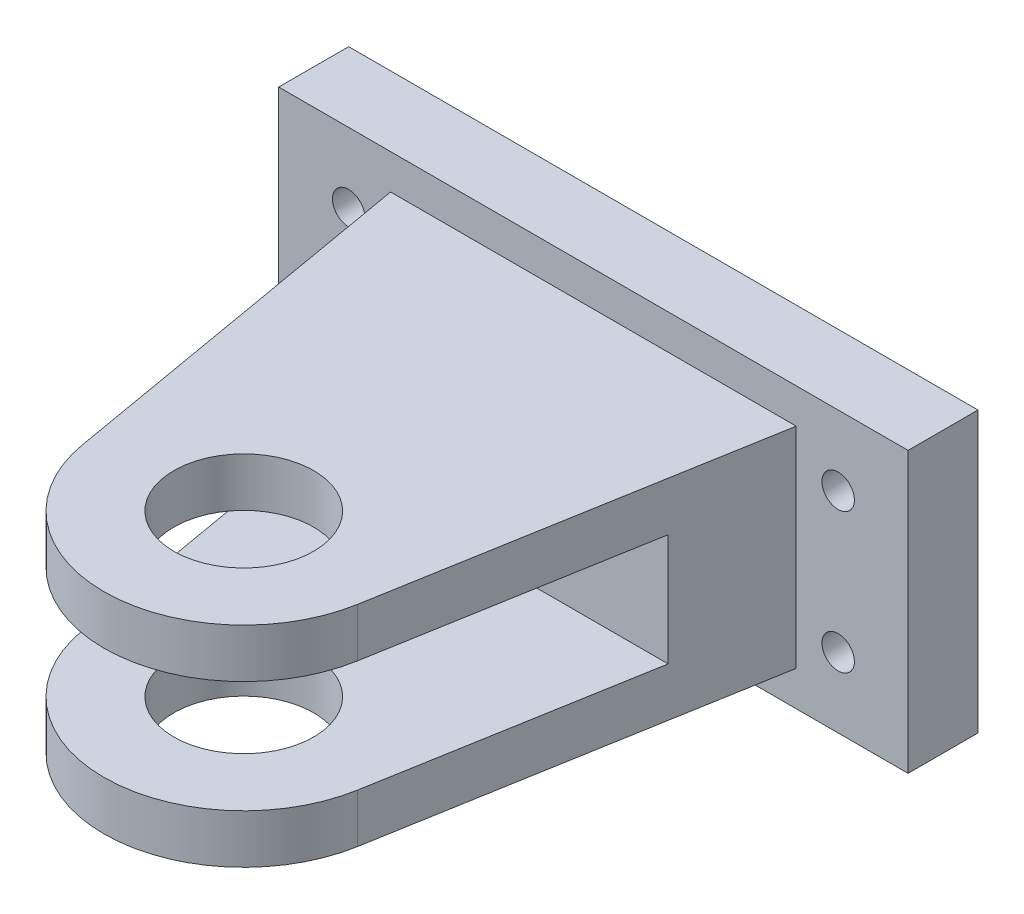
ISO-10303-21;
HEADER;
FILE_DESCRIPTION(('STEP AP214'),'2;1');
FILE_NAME('part.step','',(''),(''),'','','');
FILE_SCHEMA(('AUTOMOTIVE_DESIGN { 1 0 10303 214 1 1 1 1 }'));
ENDSEC;
DATA;
#1=APPLICATION_CONTEXT('core data for automotive mechanical design processes');
#2=APPLICATION_PROTOCOL_DEFINITION('international standard','automotive_design',2000,#1);
#3=PRODUCT_CONTEXT('',#1,'mechanical');
#4=PRODUCT('Part','Part','',(#3));
#5=PRODUCT_RELATED_PRODUCT_CATEGORY('part','',(#4));
#6=PRODUCT_DEFINITION_FORMATION('','',#4);
#7=PRODUCT_DEFINITION_CONTEXT('part definition',#1,'design');
#8=PRODUCT_DEFINITION('design','',#6,#7);
#9=PRODUCT_DEFINITION_SHAPE('','',#8);
#10=(LENGTH_UNIT() NAMED_UNIT(*) SI_UNIT(.MILLI.,.METRE.));
#11=(NAMED_UNIT(*) PLANE_ANGLE_UNIT() SI_UNIT($,.RADIAN.));
#12=(NAMED_UNIT(*) SI_UNIT($,.STERADIAN.) SOLID_ANGLE_UNIT());
#13=UNCERTAINTY_MEASURE_WITH_UNIT(LENGTH_MEASURE(1.E-05),#10,'distance_accuracy_value','');
#14=(GEOMETRIC_REPRESENTATION_CONTEXT(3) GLOBAL_UNCERTAINTY_ASSIGNED_CONTEXT((#13)) GLOBAL_UNIT_ASSIGNED_CONTEXT((#10,
#11,#12)) REPRESENTATION_CONTEXT('',''));
#15=CARTESIAN_POINT('',(0.,0.,0.));
#16=DIRECTION('',(0.,0.,1.));
#17=DIRECTION('',(1.,0.,0.));
#18=AXIS2_PLACEMENT_3D('',#15,#16,#17);
#19=CARTESIAN_POINT('',(0.,9.525,38.1));
#20=DIRECTION('',(0.,-1.,0.));
#21=DIRECTION('',(0.,0.,-1.));
#22=AXIS2_PLACEMENT_3D('',#19,#20,#21);
#23=CYLINDRICAL_SURFACE('',#22,12.7);
#24=CARTESIAN_POINT('',(0.,-5.08,38.1));
#25=DIRECTION('',(0.,1.,0.));
#26=DIRECTION('',(0.,0.,1.));
#27=AXIS2_PLACEMENT_3D('',#24,#25,#26);
#28=CIRCLE('',#27,12.7);
#29=CARTESIAN_POINT('',(-12.5120254510353,-5.08,40.2769747616005));
#30=VERTEX_POINT('',#29);
#31=CARTESIAN_POINT('',(12.5120254510353,-5.08,40.2769747616005));
#32=VERTEX_POINT('',#31);
#33=EDGE_CURVE('E132',#30,#32,#28,.T.);
#34=ORIENTED_EDGE('',*,*,#33,.F.);
#35=DIRECTION('',(0.,-1.,0.));
#36=VECTOR('',#35,1.);
#37=CARTESIAN_POINT('',(-12.5120254510353,9.525,40.2769747616005));
#38=LINE('',#37,#36);
#39=CARTESIAN_POINT('',(-12.5120254510353,-9.525,40.2769747616005));
#40=VERTEX_POINT('',#39);
#41=EDGE_CURVE('E144',#30,#40,#38,.T.);
#42=ORIENTED_EDGE('',*,*,#41,.T.);
#43=CARTESIAN_POINT('',(0.,-9.525,38.1));
#44=DIRECTION('',(0.,1.,0.));
#45=DIRECTION('',(0.,0.,1.));
#46=AXIS2_PLACEMENT_3D('',#43,#44,#45);
#47=CIRCLE('',#46,12.7);
#48=CARTESIAN_POINT('',(12.5120254510353,-9.525,40.2769747616005));
#49=VERTEX_POINT('',#48);
#50=EDGE_CURVE('E235',#40,#49,#47,.T.);
#51=ORIENTED_EDGE('',*,*,#50,.T.);
#52=DIRECTION('',(0.,-1.,0.));
#53=VECTOR('',#52,1.);
#54=CARTESIAN_POINT('',(12.5120254510353,9.525,40.2769747616005));
#55=LINE('',#54,#53);
#56=EDGE_CURVE('E146',#32,#49,#55,.T.);
#57=ORIENTED_EDGE('',*,*,#56,.F.);
#58=EDGE_LOOP('',(#34,#42,#51,#57));
#59=FACE_BOUND('',#58,.T.);
#60=ADVANCED_FACE('F37',(#59),#23,.T.);
#61=CARTESIAN_POINT('',(12.5120254510353,9.525,40.2769747616005));
#62=DIRECTION('',(-0.985198854412227,0.,-0.171415335559091));
#63=DIRECTION('',(-0.171415335559091,0.,0.985198854412227));
#64=AXIS2_PLACEMENT_3D('',#61,#62,#63);
#65=PLANE('',#64);
#66=DIRECTION('',(0.171415335559091,0.,-0.985198854412227));
#67=VECTOR('',#66,1.);
#68=CARTESIAN_POINT('',(12.5120254510353,-5.08,40.2769747616005));
#69=LINE('',#68,#67);
#70=CARTESIAN_POINT('',(16.6914491590265,-5.08,16.256));
#71=VERTEX_POINT('',#70);
#72=EDGE_CURVE('E147',#32,#71,#69,.T.);
#73=ORIENTED_EDGE('',*,*,#72,.F.);
#74=ORIENTED_EDGE('',*,*,#56,.T.);
#75=DIRECTION('',(0.171415335559091,0.,-0.985198854412227));
#76=VECTOR('',#75,1.);
#77=CARTESIAN_POINT('',(12.5120254510353,-9.525,40.2769747616005));
#78=LINE('',#77,#76);
#79=CARTESIAN_POINT('',(18.415,-9.525,6.35));
#80=VERTEX_POINT('',#79);
#81=EDGE_CURVE('E62',#49,#80,#78,.T.);
#82=ORIENTED_EDGE('',*,*,#81,.T.);
#83=DIRECTION('',(0.,-1.,0.));
#84=VECTOR('',#83,1.);
#85=CARTESIAN_POINT('',(18.415,9.525,6.35));
#86=LINE('',#85,#84);
#87=CARTESIAN_POINT('',(18.415,9.525,6.35));
#88=VERTEX_POINT('',#87);
#89=EDGE_CURVE('E164',#88,#80,#86,.T.);
#90=ORIENTED_EDGE('',*,*,#89,.F.);
#91=DIRECTION('',(0.171415335559091,0.,-0.985198854412227));
#92=VECTOR('',#91,1.);
#93=CARTESIAN_POINT('',(12.5120254510353,9.525,40.2769747616005));
#94=LINE('',#93,#92);
#95=CARTESIAN_POINT('',(12.5120254510353,9.525,40.2769747616005));
#96=VERTEX_POINT('',#95);
#97=EDGE_CURVE('E241',#96,#88,#94,.T.);
#98=ORIENTED_EDGE('',*,*,#97,.F.);
#99=CARTESIAN_POINT('',(12.5120254510353,5.08,40.2769747616005));
#100=VERTEX_POINT('',#99);
#101=EDGE_CURVE('E167',#96,#100,#55,.T.);
#102=ORIENTED_EDGE('',*,*,#101,.T.);
#103=DIRECTION('',(0.171415335559091,0.,-0.985198854412227));
#104=VECTOR('',#103,1.);
#105=CARTESIAN_POINT('',(12.5120254510353,5.08,40.2769747616005));
#106=LINE('',#105,#104);
#107=CARTESIAN_POINT('',(16.6914491590265,5.08,16.256));
#108=VERTEX_POINT('',#107);
#109=EDGE_CURVE('E301',#100,#108,#106,.T.);
#110=ORIENTED_EDGE('',*,*,#109,.T.);
#111=DIRECTION('',(0.,1.,0.));
#112=VECTOR('',#111,1.);
#113=CARTESIAN_POINT('',(16.6914491590265,-5.08,16.256));
#114=LINE('',#113,#112);
#115=EDGE_CURVE('E226',#71,#108,#114,.T.);
#116=ORIENTED_EDGE('',*,*,#115,.F.);
#117=EDGE_LOOP('',(#73,#74,#82,#90,#98,#102,#110,#116));
#118=FACE_BOUND('',#117,.T.);
#119=ADVANCED_FACE('F280',(#118),#65,.F.);
#120=CARTESIAN_POINT('',(-12.5120254510353,9.525,40.2769747616005));
#121=DIRECTION('',(0.985198854412227,0.,-0.171415335559091));
#122=DIRECTION('',(-0.171415335559091,0.,-0.985198854412227));
#123=AXIS2_PLACEMENT_3D('',#120,#121,#122);
#124=PLANE('',#123);
#125=DIRECTION('',(0.171415335559092,0.,0.985198854412227));
#126=VECTOR('',#125,1.);
#127=CARTESIAN_POINT('',(-16.6914491590265,-5.08,16.256));
#128=LINE('',#127,#126);
#129=CARTESIAN_POINT('',(-16.6914491590265,-5.08,16.256));
#130=VERTEX_POINT('',#129);
#131=EDGE_CURVE('E129',#130,#30,#128,.T.);
#132=ORIENTED_EDGE('',*,*,#131,.F.);
#133=DIRECTION('',(0.,1.,0.));
#134=VECTOR('',#133,1.);
#135=CARTESIAN_POINT('',(-16.6914491590265,-5.08,16.256));
#136=LINE('',#135,#134);
#137=CARTESIAN_POINT('',(-16.6914491590265,5.08,16.256));
#138=VERTEX_POINT('',#137);
#139=EDGE_CURVE('E221',#130,#138,#136,.T.);
#140=ORIENTED_EDGE('',*,*,#139,.T.);
#141=DIRECTION('',(0.171415335559092,0.,0.985198854412227));
#142=VECTOR('',#141,1.);
#143=CARTESIAN_POINT('',(-16.6914491590265,5.08,16.256));
#144=LINE('',#143,#142);
#145=CARTESIAN_POINT('',(-12.5120254510353,5.08,40.2769747616005));
#146=VERTEX_POINT('',#145);
#147=EDGE_CURVE('E297',#138,#146,#144,.T.);
#148=ORIENTED_EDGE('',*,*,#147,.T.);
#149=CARTESIAN_POINT('',(-12.5120254510353,9.525,40.2769747616005));
#150=VERTEX_POINT('',#149);
#151=EDGE_CURVE('E153',#150,#146,#38,.T.);
#152=ORIENTED_EDGE('',*,*,#151,.F.);
#153=DIRECTION('',(0.171415335559091,0.,0.985198854412227));
#154=VECTOR('',#153,1.);
#155=CARTESIAN_POINT('',(-12.5120254510353,9.525,40.2769747616005));
#156=LINE('',#155,#154);
#157=CARTESIAN_POINT('',(-18.415,9.525,6.35));
#158=VERTEX_POINT('',#157);
#159=EDGE_CURVE('E154',#158,#150,#156,.T.);
#160=ORIENTED_EDGE('',*,*,#159,.F.);
#161=DIRECTION('',(0.,-1.,0.));
#162=VECTOR('',#161,1.);
#163=CARTESIAN_POINT('',(-18.415,9.525,6.35));
#164=LINE('',#163,#162);
#165=CARTESIAN_POINT('',(-18.415,-9.525,6.35));
#166=VERTEX_POINT('',#165);
#167=EDGE_CURVE('E157',#158,#166,#164,.T.);
#168=ORIENTED_EDGE('',*,*,#167,.T.);
#169=DIRECTION('',(0.171415335559091,0.,0.985198854412227));
#170=VECTOR('',#169,1.);
#171=CARTESIAN_POINT('',(-12.5120254510353,-9.525,40.2769747616005));
#172=LINE('',#171,#170);
#173=EDGE_CURVE('E151',#166,#40,#172,.T.);
#174=ORIENTED_EDGE('',*,*,#173,.T.);
#175=ORIENTED_EDGE('',*,*,#41,.F.);
#176=EDGE_LOOP('',(#132,#140,#148,#152,#160,#168,#174,#175));
#177=FACE_BOUND('',#176,.T.);
#178=ADVANCED_FACE('F149',(#177),#124,.F.);
#179=CARTESIAN_POINT('',(0.,9.525,38.1));
#180=DIRECTION('',(0.,-1.,0.));
#181=DIRECTION('',(0.,0.,-1.));
#182=AXIS2_PLACEMENT_3D('',#179,#180,#181);
#183=CYLINDRICAL_SURFACE('',#182,6.35);
#184=CARTESIAN_POINT('',(0.,-9.525,38.1));
#185=DIRECTION('',(0.,1.,0.));
#186=DIRECTION('',(0.,0.,1.));
#187=AXIS2_PLACEMENT_3D('',#184,#185,#186);
#188=CIRCLE('',#187,6.35);
#189=CARTESIAN_POINT('',(0.,-9.525,44.45));
#190=VERTEX_POINT('',#189);
#191=EDGE_CURVE('E225',#190,#190,#188,.T.);
#192=ORIENTED_EDGE('',*,*,#191,.F.);
#193=EDGE_LOOP('',(#192));
#194=FACE_BOUND('',#193,.T.);
#195=CARTESIAN_POINT('',(0.,-5.08,38.1));
#196=DIRECTION('',(0.,1.,0.));
#197=DIRECTION('',(0.,0.,1.));
#198=AXIS2_PLACEMENT_3D('',#195,#196,#197);
#199=CIRCLE('',#198,6.35);
#200=CARTESIAN_POINT('',(0.,-5.08,44.45));
#201=VERTEX_POINT('',#200);
#202=EDGE_CURVE('E41',#201,#201,#199,.T.);
#203=ORIENTED_EDGE('',*,*,#202,.T.);
#204=EDGE_LOOP('',(#203));
#205=FACE_BOUND('',#204,.T.);
#206=ADVANCED_FACE('F261',(#194,#205),#183,.F.);
#207=CARTESIAN_POINT('',(0.,0.,6.35));
#208=DIRECTION('',(0.,0.,-1.));
#209=DIRECTION('',(-1.,0.,0.));
#210=AXIS2_PLACEMENT_3D('',#207,#208,#209);
#211=PLANE('',#210);
#212=ORIENTED_EDGE('',*,*,#89,.T.);
#213=DIRECTION('',(-1.,0.,0.));
#214=VECTOR('',#213,1.);
#215=CARTESIAN_POINT('',(-18.415,-9.525,6.35));
#216=LINE('',#215,#214);
#217=EDGE_CURVE('E245',#80,#166,#216,.T.);
#218=ORIENTED_EDGE('',*,*,#217,.T.);
#219=ORIENTED_EDGE('',*,*,#167,.F.);
#220=DIRECTION('',(-1.,0.,0.));
#221=VECTOR('',#220,1.);
#222=CARTESIAN_POINT('',(-18.415,9.525,6.35));
#223=LINE('',#222,#221);
#224=EDGE_CURVE('E158',#88,#158,#223,.T.);
#225=ORIENTED_EDGE('',*,*,#224,.F.);
#226=EDGE_LOOP('',(#212,#218,#219,#225));
#227=FACE_BOUND('',#226,.T.);
#228=DIRECTION('',(0.,1.,0.));
#229=VECTOR('',#228,1.);
#230=CARTESIAN_POINT('',(28.575,-12.7,6.35));
#231=LINE('',#230,#229);
#232=CARTESIAN_POINT('',(28.575,-12.7,6.35));
#233=VERTEX_POINT('',#232);
#234=CARTESIAN_POINT('',(28.575,12.7,6.35));
#235=VERTEX_POINT('',#234);
#236=EDGE_CURVE('E195',#233,#235,#231,.T.);
#237=ORIENTED_EDGE('',*,*,#236,.T.);
#238=DIRECTION('',(-1.,0.,0.));
#239=VECTOR('',#238,1.);
#240=CARTESIAN_POINT('',(-28.575,12.7,6.35));
#241=LINE('',#240,#239);
#242=CARTESIAN_POINT('',(-28.575,12.7,6.35));
#243=VERTEX_POINT('',#242);
#244=EDGE_CURVE('E198',#235,#243,#241,.T.);
#245=ORIENTED_EDGE('',*,*,#244,.T.);
#246=DIRECTION('',(0.,-1.,0.));
#247=VECTOR('',#246,1.);
#248=CARTESIAN_POINT('',(-28.575,-12.7,6.35));
#249=LINE('',#248,#247);
#250=CARTESIAN_POINT('',(-28.575,-12.7,6.35));
#251=VERTEX_POINT('',#250);
#252=EDGE_CURVE('E201',#243,#251,#249,.T.);
#253=ORIENTED_EDGE('',*,*,#252,.T.);
#254=DIRECTION('',(1.,0.,0.));
#255=VECTOR('',#254,1.);
#256=CARTESIAN_POINT('',(-28.575,-12.7,6.35));
#257=LINE('',#256,#255);
#258=EDGE_CURVE('E203',#251,#233,#257,.T.);
#259=ORIENTED_EDGE('',*,*,#258,.T.);
#260=EDGE_LOOP('',(#237,#245,#253,#259));
#261=FACE_BOUND('',#260,.T.);
#262=CARTESIAN_POINT('',(22.225,6.35,6.35));
#263=DIRECTION('',(0.,0.,1.));
#264=DIRECTION('',(1.,0.,0.));
#265=AXIS2_PLACEMENT_3D('',#262,#263,#264);
#266=CIRCLE('',#265,1.4732);
#267=CARTESIAN_POINT('',(23.6982,6.35,6.35));
#268=VERTEX_POINT('',#267);
#269=EDGE_CURVE('E188',#268,#268,#266,.T.);
#270=ORIENTED_EDGE('',*,*,#269,.F.);
#271=EDGE_LOOP('',(#270));
#272=FACE_BOUND('',#271,.T.);
#273=CARTESIAN_POINT('',(-22.225,-6.35,6.35));
#274=DIRECTION('',(0.,0.,1.));
#275=DIRECTION('',(1.,0.,0.));
#276=AXIS2_PLACEMENT_3D('',#273,#274,#275);
#277=CIRCLE('',#276,1.4732);
#278=CARTESIAN_POINT('',(-20.7518,-6.35,6.35));
#279=VERTEX_POINT('',#278);
#280=EDGE_CURVE('E182',#279,#279,#277,.T.);
#281=ORIENTED_EDGE('',*,*,#280,.F.);
#282=EDGE_LOOP('',(#281));
#283=FACE_BOUND('',#282,.T.);
#284=CARTESIAN_POINT('',(22.225,-6.35,6.35));
#285=DIRECTION('',(0.,0.,1.));
#286=DIRECTION('',(1.,0.,0.));
#287=AXIS2_PLACEMENT_3D('',#284,#285,#286);
#288=CIRCLE('',#287,1.4732);
#289=CARTESIAN_POINT('',(23.6982,-6.35,6.35));
#290=VERTEX_POINT('',#289);
#291=EDGE_CURVE('E176',#290,#290,#288,.T.);
#292=ORIENTED_EDGE('',*,*,#291,.F.);
#293=EDGE_LOOP('',(#292));
#294=FACE_BOUND('',#293,.T.);
#295=CARTESIAN_POINT('',(-22.225,6.35,6.35));
#296=DIRECTION('',(0.,0.,1.));
#297=DIRECTION('',(1.,0.,0.));
#298=AXIS2_PLACEMENT_3D('',#295,#296,#297);
#299=CIRCLE('',#298,1.4732);
#300=CARTESIAN_POINT('',(-20.7518,6.35,6.35));
#301=VERTEX_POINT('',#300);
#302=EDGE_CURVE('E170',#301,#301,#299,.T.);
#303=ORIENTED_EDGE('',*,*,#302,.F.);
#304=EDGE_LOOP('',(#303));
#305=FACE_BOUND('',#304,.T.);
#306=ADVANCED_FACE('F249',(#227,#261,#272,#283,#294,#305),#211,.F.);
#307=CARTESIAN_POINT('',(28.575,-12.7,6.35));
#308=DIRECTION('',(-1.,0.,0.));
#309=DIRECTION('',(0.,0.,1.));
#310=AXIS2_PLACEMENT_3D('',#307,#308,#309);
#311=PLANE('',#310);
#312=DIRECTION('',(0.,1.,0.));
#313=VECTOR('',#312,1.);
#314=CARTESIAN_POINT('',(28.575,-12.7,0.));
#315=LINE('',#314,#313);
#316=CARTESIAN_POINT('',(28.575,-12.7,0.));
#317=VERTEX_POINT('',#316);
#318=CARTESIAN_POINT('',(28.575,12.7,0.));
#319=VERTEX_POINT('',#318);
#320=EDGE_CURVE('E194',#317,#319,#315,.T.);
#321=ORIENTED_EDGE('',*,*,#320,.T.);
#322=DIRECTION('',(0.,0.,-1.));
#323=VECTOR('',#322,1.);
#324=CARTESIAN_POINT('',(28.575,12.7,6.35));
#325=LINE('',#324,#323);
#326=EDGE_CURVE('E11',#235,#319,#325,.T.);
#327=ORIENTED_EDGE('',*,*,#326,.F.);
#328=ORIENTED_EDGE('',*,*,#236,.F.);
#329=DIRECTION('',(0.,0.,-1.));
#330=VECTOR('',#329,1.);
#331=CARTESIAN_POINT('',(28.575,-12.7,6.35));
#332=LINE('',#331,#330);
#333=EDGE_CURVE('E205',#233,#317,#332,.T.);
#334=ORIENTED_EDGE('',*,*,#333,.T.);
#335=EDGE_LOOP('',(#321,#327,#328,#334));
#336=FACE_BOUND('',#335,.T.);
#337=ADVANCED_FACE('F39',(#336),#311,.F.);
#338=CARTESIAN_POINT('',(-28.575,12.7,6.35));
#339=DIRECTION('',(0.,-1.,0.));
#340=DIRECTION('',(0.,0.,-1.));
#341=AXIS2_PLACEMENT_3D('',#338,#339,#340);
#342=PLANE('',#341);
#343=DIRECTION('',(-1.,0.,0.));
#344=VECTOR('',#343,1.);
#345=CARTESIAN_POINT('',(-28.575,12.7,0.));
#346=LINE('',#345,#344);
#347=CARTESIAN_POINT('',(-28.575,12.7,0.));
#348=VERTEX_POINT('',#347);
#349=EDGE_CURVE('E208',#319,#348,#346,.T.);
#350=ORIENTED_EDGE('',*,*,#349,.T.);
#351=DIRECTION('',(0.,0.,-1.));
#352=VECTOR('',#351,1.);
#353=CARTESIAN_POINT('',(-28.575,12.7,6.35));
#354=LINE('',#353,#352);
#355=EDGE_CURVE('E46',#243,#348,#354,.T.);
#356=ORIENTED_EDGE('',*,*,#355,.F.);
#357=ORIENTED_EDGE('',*,*,#244,.F.);
#358=ORIENTED_EDGE('',*,*,#326,.T.);
#359=EDGE_LOOP('',(#350,#356,#357,#358));
#360=FACE_BOUND('',#359,.T.);
#361=ADVANCED_FACE('F342',(#360),#342,.F.);
#362=CARTESIAN_POINT('',(-28.575,-12.7,6.35));
#363=DIRECTION('',(1.,0.,0.));
#364=DIRECTION('',(0.,0.,-1.));
#365=AXIS2_PLACEMENT_3D('',#362,#363,#364);
#366=PLANE('',#365);
#367=DIRECTION('',(0.,-1.,0.));
#368=VECTOR('',#367,1.);
#369=CARTESIAN_POINT('',(-28.575,-12.7,0.));
#370=LINE('',#369,#368);
#371=CARTESIAN_POINT('',(-28.575,-12.7,0.));
#372=VERTEX_POINT('',#371);
#373=EDGE_CURVE('E210',#348,#372,#370,.T.);
#374=ORIENTED_EDGE('',*,*,#373,.T.);
#375=DIRECTION('',(0.,0.,-1.));
#376=VECTOR('',#375,1.);
#377=CARTESIAN_POINT('',(-28.575,-12.7,6.35));
#378=LINE('',#377,#376);
#379=EDGE_CURVE('E215',#251,#372,#378,.T.);
#380=ORIENTED_EDGE('',*,*,#379,.F.);
#381=ORIENTED_EDGE('',*,*,#252,.F.);
#382=ORIENTED_EDGE('',*,*,#355,.T.);
#383=EDGE_LOOP('',(#374,#380,#381,#382));
#384=FACE_BOUND('',#383,.T.);
#385=ADVANCED_FACE('F349',(#384),#366,.F.);
#386=CARTESIAN_POINT('',(-28.575,-12.7,6.35));
#387=DIRECTION('',(0.,1.,0.));
#388=DIRECTION('',(0.,0.,1.));
#389=AXIS2_PLACEMENT_3D('',#386,#387,#388);
#390=PLANE('',#389);
#391=DIRECTION('',(1.,0.,0.));
#392=VECTOR('',#391,1.);
#393=CARTESIAN_POINT('',(-28.575,-12.7,0.));
#394=LINE('',#393,#392);
#395=EDGE_CURVE('E199',#372,#317,#394,.T.);
#396=ORIENTED_EDGE('',*,*,#395,.T.);
#397=ORIENTED_EDGE('',*,*,#333,.F.);
#398=ORIENTED_EDGE('',*,*,#258,.F.);
#399=ORIENTED_EDGE('',*,*,#379,.T.);
#400=EDGE_LOOP('',(#396,#397,#398,#399));
#401=FACE_BOUND('',#400,.T.);
#402=ADVANCED_FACE('F356',(#401),#390,.F.);
#403=CARTESIAN_POINT('',(0.,0.,0.));
#404=DIRECTION('',(0.,0.,-1.));
#405=DIRECTION('',(-1.,0.,0.));
#406=AXIS2_PLACEMENT_3D('',#403,#404,#405);
#407=PLANE('',#406);
#408=CARTESIAN_POINT('',(-22.225,6.35,0.));
#409=DIRECTION('',(0.,0.,-1.));
#410=DIRECTION('',(-1.,0.,0.));
#411=AXIS2_PLACEMENT_3D('',#408,#409,#410);
#412=CIRCLE('',#411,1.4732);
#413=CARTESIAN_POINT('',(-23.6982,6.35,0.));
#414=VERTEX_POINT('',#413);
#415=EDGE_CURVE('E173',#414,#414,#412,.T.);
#416=ORIENTED_EDGE('',*,*,#415,.F.);
#417=EDGE_LOOP('',(#416));
#418=FACE_BOUND('',#417,.T.);
#419=CARTESIAN_POINT('',(22.225,-6.35,0.));
#420=DIRECTION('',(0.,0.,-1.));
#421=DIRECTION('',(-1.,0.,0.));
#422=AXIS2_PLACEMENT_3D('',#419,#420,#421);
#423=CIRCLE('',#422,1.4732);
#424=CARTESIAN_POINT('',(20.7518,-6.35,0.));
#425=VERTEX_POINT('',#424);
#426=EDGE_CURVE('E179',#425,#425,#423,.T.);
#427=ORIENTED_EDGE('',*,*,#426,.F.);
#428=EDGE_LOOP('',(#427));
#429=FACE_BOUND('',#428,.T.);
#430=CARTESIAN_POINT('',(-22.225,-6.35,0.));
#431=DIRECTION('',(0.,0.,-1.));
#432=DIRECTION('',(-1.,0.,0.));
#433=AXIS2_PLACEMENT_3D('',#430,#431,#432);
#434=CIRCLE('',#433,1.4732);
#435=CARTESIAN_POINT('',(-23.6982,-6.35,0.));
#436=VERTEX_POINT('',#435);
#437=EDGE_CURVE('E185',#436,#436,#434,.T.);
#438=ORIENTED_EDGE('',*,*,#437,.F.);
#439=EDGE_LOOP('',(#438));
#440=FACE_BOUND('',#439,.T.);
#441=CARTESIAN_POINT('',(22.225,6.35,0.));
#442=DIRECTION('',(0.,0.,-1.));
#443=DIRECTION('',(-1.,0.,0.));
#444=AXIS2_PLACEMENT_3D('',#441,#442,#443);
#445=CIRCLE('',#444,1.4732);
#446=CARTESIAN_POINT('',(20.7518,6.35,0.));
#447=VERTEX_POINT('',#446);
#448=EDGE_CURVE('E191',#447,#447,#445,.T.);
#449=ORIENTED_EDGE('',*,*,#448,.F.);
#450=EDGE_LOOP('',(#449));
#451=FACE_BOUND('',#450,.T.);
#452=ORIENTED_EDGE('',*,*,#320,.F.);
#453=ORIENTED_EDGE('',*,*,#395,.F.);
#454=ORIENTED_EDGE('',*,*,#373,.F.);
#455=ORIENTED_EDGE('',*,*,#349,.F.);
#456=EDGE_LOOP('',(#452,#453,#454,#455));
#457=FACE_BOUND('',#456,.T.);
#458=ADVANCED_FACE('F364',(#418,#429,#440,#451,#457),#407,.T.);
#459=CARTESIAN_POINT('',(22.225,6.35,6.35));
#460=DIRECTION('',(0.,0.,1.));
#461=DIRECTION('',(1.,0.,0.));
#462=AXIS2_PLACEMENT_3D('',#459,#460,#461);
#463=CYLINDRICAL_SURFACE('',#462,1.4732);
#464=ORIENTED_EDGE('',*,*,#269,.T.);
#465=EDGE_LOOP('',(#464));
#466=FACE_BOUND('',#465,.T.);
#467=ORIENTED_EDGE('',*,*,#448,.T.);
#468=EDGE_LOOP('',(#467));
#469=FACE_BOUND('',#468,.T.);
#470=ADVANCED_FACE('F372',(#466,#469),#463,.F.);
#471=CARTESIAN_POINT('',(-22.225,-6.35,6.35));
#472=DIRECTION('',(0.,0.,1.));
#473=DIRECTION('',(1.,0.,0.));
#474=AXIS2_PLACEMENT_3D('',#471,#472,#473);
#475=CYLINDRICAL_SURFACE('',#474,1.4732);
#476=ORIENTED_EDGE('',*,*,#280,.T.);
#477=EDGE_LOOP('',(#476));
#478=FACE_BOUND('',#477,.T.);
#479=ORIENTED_EDGE('',*,*,#437,.T.);
#480=EDGE_LOOP('',(#479));
#481=FACE_BOUND('',#480,.T.);
#482=ADVANCED_FACE('F380',(#478,#481),#475,.F.);
#483=CARTESIAN_POINT('',(22.225,-6.35,6.35));
#484=DIRECTION('',(0.,0.,1.));
#485=DIRECTION('',(1.,0.,0.));
#486=AXIS2_PLACEMENT_3D('',#483,#484,#485);
#487=CYLINDRICAL_SURFACE('',#486,1.4732);
#488=ORIENTED_EDGE('',*,*,#291,.T.);
#489=EDGE_LOOP('',(#488));
#490=FACE_BOUND('',#489,.T.);
#491=ORIENTED_EDGE('',*,*,#426,.T.);
#492=EDGE_LOOP('',(#491));
#493=FACE_BOUND('',#492,.T.);
#494=ADVANCED_FACE('F317',(#490,#493),#487,.F.);
#495=CARTESIAN_POINT('',(-22.225,6.35,6.35));
#496=DIRECTION('',(0.,0.,1.));
#497=DIRECTION('',(1.,0.,0.));
#498=AXIS2_PLACEMENT_3D('',#495,#496,#497);
#499=CYLINDRICAL_SURFACE('',#498,1.4732);
#500=ORIENTED_EDGE('',*,*,#302,.T.);
#501=EDGE_LOOP('',(#500));
#502=FACE_BOUND('',#501,.T.);
#503=ORIENTED_EDGE('',*,*,#415,.T.);
#504=EDGE_LOOP('',(#503));
#505=FACE_BOUND('',#504,.T.);
#506=ADVANCED_FACE('F310',(#502,#505),#499,.F.);
#507=CARTESIAN_POINT('',(0.,9.525,38.1));
#508=DIRECTION('',(0.,1.,0.));
#509=DIRECTION('',(0.,0.,1.));
#510=AXIS2_PLACEMENT_3D('',#507,#508,#509);
#511=PLANE('',#510);
#512=ORIENTED_EDGE('',*,*,#97,.T.);
#513=ORIENTED_EDGE('',*,*,#224,.T.);
#514=ORIENTED_EDGE('',*,*,#159,.T.);
#515=CARTESIAN_POINT('',(0.,9.525,38.1));
#516=DIRECTION('',(0.,1.,0.));
#517=DIRECTION('',(0.,0.,1.));
#518=AXIS2_PLACEMENT_3D('',#515,#516,#517);
#519=CIRCLE('',#518,12.7);
#520=EDGE_CURVE('E238',#150,#96,#519,.T.);
#521=ORIENTED_EDGE('',*,*,#520,.T.);
#522=EDGE_LOOP('',(#512,#513,#514,#521));
#523=FACE_BOUND('',#522,.T.);
#524=CARTESIAN_POINT('',(0.,9.525,38.1));
#525=DIRECTION('',(0.,1.,0.));
#526=DIRECTION('',(0.,0.,1.));
#527=AXIS2_PLACEMENT_3D('',#524,#525,#526);
#528=CIRCLE('',#527,6.35);
#529=CARTESIAN_POINT('',(0.,9.525,44.45));
#530=VERTEX_POINT('',#529);
#531=EDGE_CURVE('E232',#530,#530,#528,.T.);
#532=ORIENTED_EDGE('',*,*,#531,.F.);
#533=EDGE_LOOP('',(#532));
#534=FACE_BOUND('',#533,.T.);
#535=ADVANCED_FACE('F257',(#523,#534),#511,.T.);
#536=CARTESIAN_POINT('',(0.,-9.525,38.1));
#537=DIRECTION('',(0.,1.,0.));
#538=DIRECTION('',(0.,0.,1.));
#539=AXIS2_PLACEMENT_3D('',#536,#537,#538);
#540=PLANE('',#539);
#541=ORIENTED_EDGE('',*,*,#50,.F.);
#542=ORIENTED_EDGE('',*,*,#173,.F.);
#543=ORIENTED_EDGE('',*,*,#217,.F.);
#544=ORIENTED_EDGE('',*,*,#81,.F.);
#545=EDGE_LOOP('',(#541,#542,#543,#544));
#546=FACE_BOUND('',#545,.T.);
#547=ORIENTED_EDGE('',*,*,#191,.T.);
#548=EDGE_LOOP('',(#547));
#549=FACE_BOUND('',#548,.T.);
#550=ADVANCED_FACE('F253',(#546,#549),#540,.F.);
#551=ORIENTED_EDGE('',*,*,#151,.T.);
#552=CARTESIAN_POINT('',(0.,5.08,38.1));
#553=DIRECTION('',(0.,1.,0.));
#554=DIRECTION('',(0.,0.,1.));
#555=AXIS2_PLACEMENT_3D('',#552,#553,#554);
#556=CIRCLE('',#555,12.7);
#557=EDGE_CURVE('E54',#146,#100,#556,.T.);
#558=ORIENTED_EDGE('',*,*,#557,.T.);
#559=ORIENTED_EDGE('',*,*,#101,.F.);
#560=ORIENTED_EDGE('',*,*,#520,.F.);
#561=EDGE_LOOP('',(#551,#558,#559,#560));
#562=FACE_BOUND('',#561,.T.);
#563=ADVANCED_FACE('F256',(#562),#23,.T.);
#564=CARTESIAN_POINT('',(0.,5.08,38.1));
#565=DIRECTION('',(0.,1.,0.));
#566=DIRECTION('',(0.,0.,1.));
#567=AXIS2_PLACEMENT_3D('',#564,#565,#566);
#568=CIRCLE('',#567,6.35);
#569=CARTESIAN_POINT('',(0.,5.08,44.45));
#570=VERTEX_POINT('',#569);
#571=EDGE_CURVE('E219',#570,#570,#568,.T.);
#572=ORIENTED_EDGE('',*,*,#571,.F.);
#573=EDGE_LOOP('',(#572));
#574=FACE_BOUND('',#573,.T.);
#575=ORIENTED_EDGE('',*,*,#531,.T.);
#576=EDGE_LOOP('',(#575));
#577=FACE_BOUND('',#576,.T.);
#578=ADVANCED_FACE('F265',(#574,#577),#183,.F.);
#579=CARTESIAN_POINT('',(-16.6914491590265,-5.08,16.256));
#580=DIRECTION('',(0.,0.,-1.));
#581=DIRECTION('',(-1.,0.,0.));
#582=AXIS2_PLACEMENT_3D('',#579,#580,#581);
#583=PLANE('',#582);
#584=DIRECTION('',(-1.,0.,0.));
#585=VECTOR('',#584,1.);
#586=CARTESIAN_POINT('',(-16.6914491590265,5.08,16.256));
#587=LINE('',#586,#585);
#588=EDGE_CURVE('E139',#108,#138,#587,.T.);
#589=ORIENTED_EDGE('',*,*,#588,.T.);
#590=ORIENTED_EDGE('',*,*,#139,.F.);
#591=DIRECTION('',(-1.,0.,0.));
#592=VECTOR('',#591,1.);
#593=CARTESIAN_POINT('',(-16.6914491590265,-5.08,16.256));
#594=LINE('',#593,#592);
#595=EDGE_CURVE('E135',#71,#130,#594,.T.);
#596=ORIENTED_EDGE('',*,*,#595,.F.);
#597=ORIENTED_EDGE('',*,*,#115,.T.);
#598=EDGE_LOOP('',(#589,#590,#596,#597));
#599=FACE_BOUND('',#598,.T.);
#600=ADVANCED_FACE('F270',(#599),#583,.F.);
#601=CARTESIAN_POINT('',(0.,-5.08,38.1));
#602=DIRECTION('',(0.,1.,0.));
#603=DIRECTION('',(0.,0.,1.));
#604=AXIS2_PLACEMENT_3D('',#601,#602,#603);
#605=PLANE('',#604);
#606=ORIENTED_EDGE('',*,*,#202,.F.);
#607=EDGE_LOOP('',(#606));
#608=FACE_BOUND('',#607,.T.);
#609=ORIENTED_EDGE('',*,*,#131,.T.);
#610=ORIENTED_EDGE('',*,*,#33,.T.);
#611=ORIENTED_EDGE('',*,*,#72,.T.);
#612=ORIENTED_EDGE('',*,*,#595,.T.);
#613=EDGE_LOOP('',(#609,#610,#611,#612));
#614=FACE_BOUND('',#613,.T.);
#615=ADVANCED_FACE('F131',(#608,#614),#605,.T.);
#616=CARTESIAN_POINT('',(0.,5.08,38.1));
#617=DIRECTION('',(0.,1.,0.));
#618=DIRECTION('',(0.,0.,1.));
#619=AXIS2_PLACEMENT_3D('',#616,#617,#618);
#620=PLANE('',#619);
#621=ORIENTED_EDGE('',*,*,#571,.T.);
#622=EDGE_LOOP('',(#621));
#623=FACE_BOUND('',#622,.T.);
#624=ORIENTED_EDGE('',*,*,#147,.F.);
#625=ORIENTED_EDGE('',*,*,#588,.F.);
#626=ORIENTED_EDGE('',*,*,#109,.F.);
#627=ORIENTED_EDGE('',*,*,#557,.F.);
#628=EDGE_LOOP('',(#624,#625,#626,#627));
#629=FACE_BOUND('',#628,.T.);
#630=ADVANCED_FACE('F269',(#623,#629),#620,.F.);
#631=CLOSED_SHELL('',(#60,#119,#178,#206,#306,#337,#361,#385,#402,#458,#470,#482,#494,#506,#535,
#550,#563,#578,#600,#615,#630));
#632=MANIFOLD_SOLID_BREP('B2',#631);
#633=ADVANCED_BREP_SHAPE_REPRESENTATION('',(#18,#632),#14);
#634=SHAPE_DEFINITION_REPRESENTATION(#9,#633);
ENDSEC;
END-ISO-10303-21;
